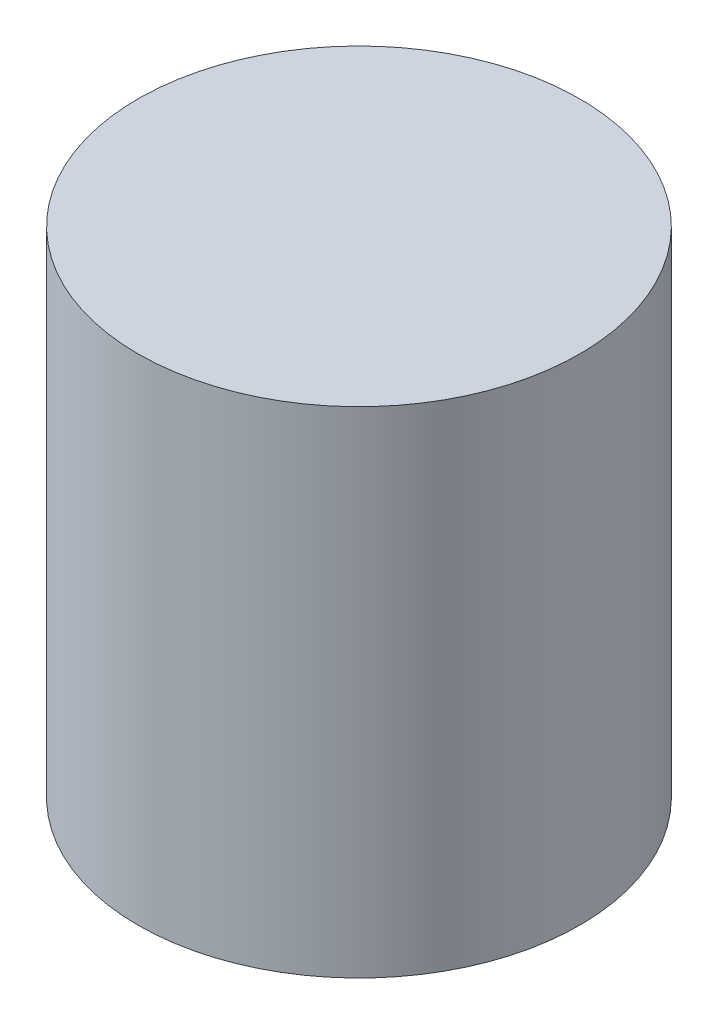
ISO-10303-21;
HEADER;
FILE_DESCRIPTION(('STEP AP214'),'2;1');
FILE_NAME('part.step','',(''),(''),'','','');
FILE_SCHEMA(('AUTOMOTIVE_DESIGN { 1 0 10303 214 1 1 1 1 }'));
ENDSEC;
DATA;
#1=APPLICATION_CONTEXT('core data for automotive mechanical design processes');
#2=APPLICATION_PROTOCOL_DEFINITION('international standard','automotive_design',2000,#1);
#3=PRODUCT_CONTEXT('',#1,'mechanical');
#4=PRODUCT('Part','Part','',(#3));
#5=PRODUCT_RELATED_PRODUCT_CATEGORY('part','',(#4));
#6=PRODUCT_DEFINITION_FORMATION('','',#4);
#7=PRODUCT_DEFINITION_CONTEXT('part definition',#1,'design');
#8=PRODUCT_DEFINITION('design','',#6,#7);
#9=PRODUCT_DEFINITION_SHAPE('','',#8);
#10=(LENGTH_UNIT() NAMED_UNIT(*) SI_UNIT(.MILLI.,.METRE.));
#11=(NAMED_UNIT(*) PLANE_ANGLE_UNIT() SI_UNIT($,.RADIAN.));
#12=(NAMED_UNIT(*) SI_UNIT($,.STERADIAN.) SOLID_ANGLE_UNIT());
#13=UNCERTAINTY_MEASURE_WITH_UNIT(LENGTH_MEASURE(1.E-05),#10,'distance_accuracy_value','');
#14=(GEOMETRIC_REPRESENTATION_CONTEXT(3) GLOBAL_UNCERTAINTY_ASSIGNED_CONTEXT((#13)) GLOBAL_UNIT_ASSIGNED_CONTEXT((#10,
#11,#12)) REPRESENTATION_CONTEXT('',''));
#15=CARTESIAN_POINT('',(0.,0.,0.));
#16=DIRECTION('',(0.,0.,1.));
#17=DIRECTION('',(1.,0.,0.));
#18=AXIS2_PLACEMENT_3D('',#15,#16,#17);
#19=CARTESIAN_POINT('',(0.,14.224,0.));
#20=DIRECTION('',(0.,-1.,0.));
#21=DIRECTION('',(0.,0.,-1.));
#22=AXIS2_PLACEMENT_3D('',#19,#20,#21);
#23=CYLINDRICAL_SURFACE('',#22,6.35);
#24=CARTESIAN_POINT('',(0.,14.224,0.));
#25=DIRECTION('',(0.,1.,0.));
#26=DIRECTION('',(0.,0.,1.));
#27=AXIS2_PLACEMENT_3D('',#24,#25,#26);
#28=CIRCLE('',#27,6.35);
#29=CARTESIAN_POINT('',(0.,14.224,6.35));
#30=VERTEX_POINT('',#29);
#31=EDGE_CURVE('E10',#30,#30,#28,.T.);
#32=ORIENTED_EDGE('',*,*,#31,.F.);
#33=EDGE_LOOP('',(#32));
#34=FACE_BOUND('',#33,.T.);
#35=CARTESIAN_POINT('',(0.,0.,0.));
#36=DIRECTION('',(0.,1.,0.));
#37=DIRECTION('',(0.,0.,1.));
#38=AXIS2_PLACEMENT_3D('',#35,#36,#37);
#39=CIRCLE('',#38,6.35);
#40=CARTESIAN_POINT('',(0.,0.,6.35));
#41=VERTEX_POINT('',#40);
#42=EDGE_CURVE('E34',#41,#41,#39,.T.);
#43=ORIENTED_EDGE('',*,*,#42,.T.);
#44=EDGE_LOOP('',(#43));
#45=FACE_BOUND('',#44,.T.);
#46=ADVANCED_FACE('F31',(#34,#45),#23,.T.);
#47=CARTESIAN_POINT('',(0.,14.224,0.));
#48=DIRECTION('',(0.,1.,0.));
#49=DIRECTION('',(0.,0.,1.));
#50=AXIS2_PLACEMENT_3D('',#47,#48,#49);
#51=PLANE('',#50);
#52=ORIENTED_EDGE('',*,*,#31,.T.);
#53=EDGE_LOOP('',(#52));
#54=FACE_BOUND('',#53,.T.);
#55=ADVANCED_FACE('F46',(#54),#51,.T.);
#56=CARTESIAN_POINT('',(0.,0.,0.));
#57=DIRECTION('',(0.,1.,0.));
#58=DIRECTION('',(0.,0.,1.));
#59=AXIS2_PLACEMENT_3D('',#56,#57,#58);
#60=PLANE('',#59);
#61=ORIENTED_EDGE('',*,*,#42,.F.);
#62=EDGE_LOOP('',(#61));
#63=FACE_BOUND('',#62,.T.);
#64=ADVANCED_FACE('F44',(#63),#60,.F.);
#65=CLOSED_SHELL('',(#46,#55,#64));
#66=MANIFOLD_SOLID_BREP('B2',#65);
#67=ADVANCED_BREP_SHAPE_REPRESENTATION('',(#18,#66),#14);
#68=SHAPE_DEFINITION_REPRESENTATION(#9,#67);
ENDSEC;
END-ISO-10303-21;
